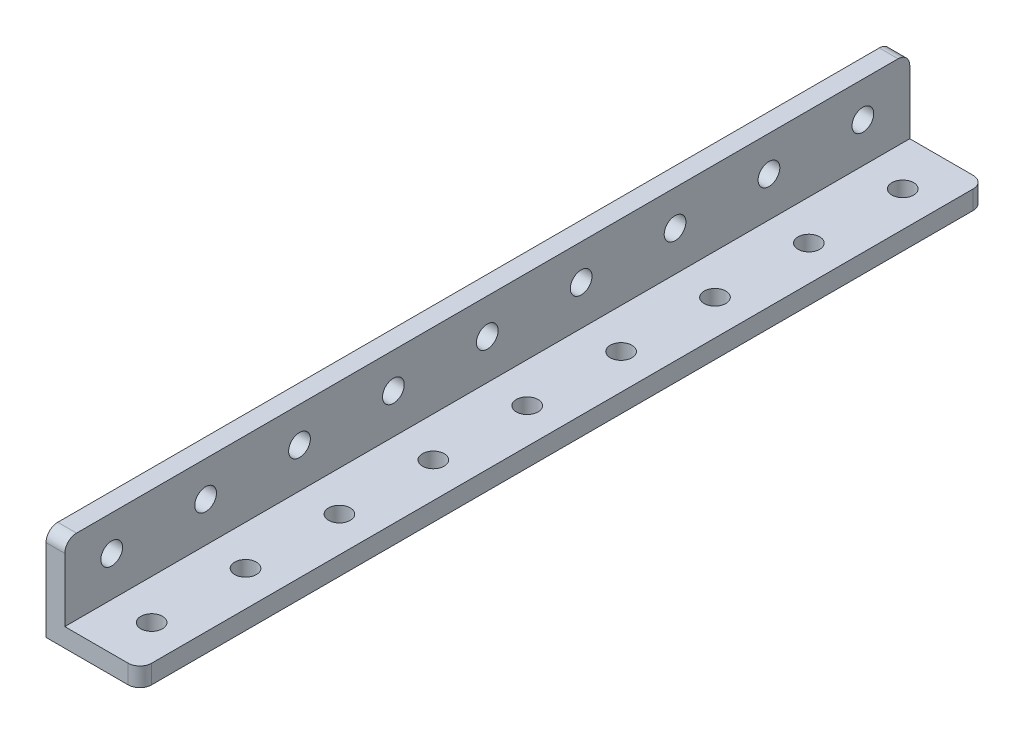
ISO-10303-21;
HEADER;
FILE_DESCRIPTION(('STEP AP214'),'2;1');
FILE_NAME('part.step','',(''),(''),'','','');
FILE_SCHEMA(('AUTOMOTIVE_DESIGN { 1 0 10303 214 1 1 1 1 }'));
ENDSEC;
DATA;
#1=APPLICATION_CONTEXT('core data for automotive mechanical design processes');
#2=APPLICATION_PROTOCOL_DEFINITION('international standard','automotive_design',2000,#1);
#3=PRODUCT_CONTEXT('',#1,'mechanical');
#4=PRODUCT('Part','Part','',(#3));
#5=PRODUCT_RELATED_PRODUCT_CATEGORY('part','',(#4));
#6=PRODUCT_DEFINITION_FORMATION('','',#4);
#7=PRODUCT_DEFINITION_CONTEXT('part definition',#1,'design');
#8=PRODUCT_DEFINITION('design','',#6,#7);
#9=PRODUCT_DEFINITION_SHAPE('','',#8);
#10=(LENGTH_UNIT() NAMED_UNIT(*) SI_UNIT(.MILLI.,.METRE.));
#11=(NAMED_UNIT(*) PLANE_ANGLE_UNIT() SI_UNIT($,.RADIAN.));
#12=(NAMED_UNIT(*) SI_UNIT($,.STERADIAN.) SOLID_ANGLE_UNIT());
#13=UNCERTAINTY_MEASURE_WITH_UNIT(LENGTH_MEASURE(1.E-05),#10,'distance_accuracy_value','');
#14=(GEOMETRIC_REPRESENTATION_CONTEXT(3) GLOBAL_UNCERTAINTY_ASSIGNED_CONTEXT((#13)) GLOBAL_UNIT_ASSIGNED_CONTEXT((#10,
#11,#12)) REPRESENTATION_CONTEXT('',''));
#15=CARTESIAN_POINT('',(0.,0.,0.));
#16=DIRECTION('',(0.,0.,1.));
#17=DIRECTION('',(1.,0.,0.));
#18=AXIS2_PLACEMENT_3D('',#15,#16,#17);
#19=CARTESIAN_POINT('',(0.,16.,-72.));
#20=DIRECTION('',(-1.,0.,0.));
#21=DIRECTION('',(0.,-1.,0.));
#22=AXIS2_PLACEMENT_3D('',#19,#20,#21);
#23=PLANE('',#22);
#24=CARTESIAN_POINT('',(0.,10.,-64.));
#25=DIRECTION('',(-1.,0.,0.));
#26=DIRECTION('',(0.,-1.,0.));
#27=AXIS2_PLACEMENT_3D('',#24,#25,#26);
#28=CIRCLE('',#27,1.85000000000003);
#29=CARTESIAN_POINT('',(0.,8.14999999999997,-64.));
#30=VERTEX_POINT('',#29);
#31=EDGE_CURVE('E691',#30,#30,#28,.T.);
#32=ORIENTED_EDGE('',*,*,#31,.F.);
#33=EDGE_LOOP('',(#32));
#34=FACE_BOUND('',#33,.T.);
#35=CARTESIAN_POINT('',(0.,10.,-48.));
#36=DIRECTION('',(-1.,0.,0.));
#37=DIRECTION('',(0.,-1.,0.));
#38=AXIS2_PLACEMENT_3D('',#35,#36,#37);
#39=CIRCLE('',#38,1.85000000000003);
#40=CARTESIAN_POINT('',(0.,8.14999999999997,-48.));
#41=VERTEX_POINT('',#40);
#42=EDGE_CURVE('E701',#41,#41,#39,.T.);
#43=ORIENTED_EDGE('',*,*,#42,.F.);
#44=EDGE_LOOP('',(#43));
#45=FACE_BOUND('',#44,.T.);
#46=CARTESIAN_POINT('',(0.,10.,-32.));
#47=DIRECTION('',(-1.,0.,0.));
#48=DIRECTION('',(0.,-1.,0.));
#49=AXIS2_PLACEMENT_3D('',#46,#47,#48);
#50=CIRCLE('',#49,1.85000000000003);
#51=CARTESIAN_POINT('',(0.,8.14999999999997,-32.));
#52=VERTEX_POINT('',#51);
#53=EDGE_CURVE('E711',#52,#52,#50,.T.);
#54=ORIENTED_EDGE('',*,*,#53,.F.);
#55=EDGE_LOOP('',(#54));
#56=FACE_BOUND('',#55,.T.);
#57=CARTESIAN_POINT('',(0.,10.,-16.));
#58=DIRECTION('',(-1.,0.,0.));
#59=DIRECTION('',(0.,-1.,0.));
#60=AXIS2_PLACEMENT_3D('',#57,#58,#59);
#61=CIRCLE('',#60,1.85000000000003);
#62=CARTESIAN_POINT('',(0.,8.14999999999997,-16.));
#63=VERTEX_POINT('',#62);
#64=EDGE_CURVE('E721',#63,#63,#61,.T.);
#65=ORIENTED_EDGE('',*,*,#64,.F.);
#66=EDGE_LOOP('',(#65));
#67=FACE_BOUND('',#66,.T.);
#68=CARTESIAN_POINT('',(0.,10.,0.));
#69=DIRECTION('',(-1.,0.,0.));
#70=DIRECTION('',(0.,-1.,0.));
#71=AXIS2_PLACEMENT_3D('',#68,#69,#70);
#72=CIRCLE('',#71,1.85000000000003);
#73=CARTESIAN_POINT('',(0.,8.14999999999997,0.));
#74=VERTEX_POINT('',#73);
#75=EDGE_CURVE('E731',#74,#74,#72,.T.);
#76=ORIENTED_EDGE('',*,*,#75,.F.);
#77=EDGE_LOOP('',(#76));
#78=FACE_BOUND('',#77,.T.);
#79=CARTESIAN_POINT('',(0.,10.,16.));
#80=DIRECTION('',(-1.,0.,0.));
#81=DIRECTION('',(0.,-1.,0.));
#82=AXIS2_PLACEMENT_3D('',#79,#80,#81);
#83=CIRCLE('',#82,1.85000000000003);
#84=CARTESIAN_POINT('',(0.,8.14999999999997,16.));
#85=VERTEX_POINT('',#84);
#86=EDGE_CURVE('E741',#85,#85,#83,.T.);
#87=ORIENTED_EDGE('',*,*,#86,.F.);
#88=EDGE_LOOP('',(#87));
#89=FACE_BOUND('',#88,.T.);
#90=CARTESIAN_POINT('',(0.,10.,32.));
#91=DIRECTION('',(-1.,0.,0.));
#92=DIRECTION('',(0.,-1.,0.));
#93=AXIS2_PLACEMENT_3D('',#90,#91,#92);
#94=CIRCLE('',#93,1.85000000000003);
#95=CARTESIAN_POINT('',(0.,8.14999999999997,32.));
#96=VERTEX_POINT('',#95);
#97=EDGE_CURVE('E751',#96,#96,#94,.T.);
#98=ORIENTED_EDGE('',*,*,#97,.F.);
#99=EDGE_LOOP('',(#98));
#100=FACE_BOUND('',#99,.T.);
#101=CARTESIAN_POINT('',(0.,10.,48.));
#102=DIRECTION('',(-1.,0.,0.));
#103=DIRECTION('',(0.,-1.,0.));
#104=AXIS2_PLACEMENT_3D('',#101,#102,#103);
#105=CIRCLE('',#104,1.85000000000003);
#106=CARTESIAN_POINT('',(0.,8.14999999999997,48.));
#107=VERTEX_POINT('',#106);
#108=EDGE_CURVE('E761',#107,#107,#105,.T.);
#109=ORIENTED_EDGE('',*,*,#108,.F.);
#110=EDGE_LOOP('',(#109));
#111=FACE_BOUND('',#110,.T.);
#112=CARTESIAN_POINT('',(0.,10.,64.));
#113=DIRECTION('',(-1.,0.,0.));
#114=DIRECTION('',(0.,-1.,0.));
#115=AXIS2_PLACEMENT_3D('',#112,#113,#114);
#116=CIRCLE('',#115,1.85000000000003);
#117=CARTESIAN_POINT('',(0.,8.14999999999997,64.));
#118=VERTEX_POINT('',#117);
#119=EDGE_CURVE('E158',#118,#118,#116,.T.);
#120=ORIENTED_EDGE('',*,*,#119,.F.);
#121=EDGE_LOOP('',(#120));
#122=FACE_BOUND('',#121,.T.);
#123=DIRECTION('',(0.,0.,1.));
#124=VECTOR('',#123,1.);
#125=CARTESIAN_POINT('',(0.,16.,-72.));
#126=LINE('',#125,#124);
#127=CARTESIAN_POINT('',(0.,16.,-70.));
#128=VERTEX_POINT('',#127);
#129=CARTESIAN_POINT('',(0.,16.,70.));
#130=VERTEX_POINT('',#129);
#131=EDGE_CURVE('E167',#128,#130,#126,.T.);
#132=ORIENTED_EDGE('',*,*,#131,.F.);
#133=CARTESIAN_POINT('',(0.,14.,-70.));
#134=DIRECTION('',(-1.,0.,0.));
#135=DIRECTION('',(0.,-1.,0.));
#136=AXIS2_PLACEMENT_3D('',#133,#134,#135);
#137=CIRCLE('',#136,2.);
#138=CARTESIAN_POINT('',(0.,14.,-72.));
#139=VERTEX_POINT('',#138);
#140=EDGE_CURVE('E46',#128,#139,#137,.T.);
#141=ORIENTED_EDGE('',*,*,#140,.T.);
#142=DIRECTION('',(0.,-1.,0.));
#143=VECTOR('',#142,1.);
#144=CARTESIAN_POINT('',(0.,16.,-72.));
#145=LINE('',#144,#143);
#146=CARTESIAN_POINT('',(0.,0.,-72.));
#147=VERTEX_POINT('',#146);
#148=EDGE_CURVE('E118',#139,#147,#145,.T.);
#149=ORIENTED_EDGE('',*,*,#148,.T.);
#150=DIRECTION('',(0.,0.,1.));
#151=VECTOR('',#150,1.);
#152=CARTESIAN_POINT('',(0.,0.,-72.));
#153=LINE('',#152,#151);
#154=CARTESIAN_POINT('',(0.,0.,72.));
#155=VERTEX_POINT('',#154);
#156=EDGE_CURVE('E120',#147,#155,#153,.T.);
#157=ORIENTED_EDGE('',*,*,#156,.T.);
#158=DIRECTION('',(0.,-1.,0.));
#159=VECTOR('',#158,1.);
#160=CARTESIAN_POINT('',(0.,16.,72.));
#161=LINE('',#160,#159);
#162=CARTESIAN_POINT('',(0.,14.,72.));
#163=VERTEX_POINT('',#162);
#164=EDGE_CURVE('E155',#163,#155,#161,.T.);
#165=ORIENTED_EDGE('',*,*,#164,.F.);
#166=CARTESIAN_POINT('',(0.,14.,70.));
#167=DIRECTION('',(-1.,0.,0.));
#168=DIRECTION('',(0.,-1.,0.));
#169=AXIS2_PLACEMENT_3D('',#166,#167,#168);
#170=CIRCLE('',#169,2.);
#171=EDGE_CURVE('E36',#163,#130,#170,.T.);
#172=ORIENTED_EDGE('',*,*,#171,.T.);
#173=EDGE_LOOP('',(#132,#141,#149,#157,#165,#172));
#174=FACE_BOUND('',#173,.T.);
#175=ADVANCED_FACE('F15',(#34,#45,#56,#67,#78,#89,#100,#111,#122,#174),#23,.T.);
#176=CARTESIAN_POINT('',(3.2,16.,-72.));
#177=DIRECTION('',(0.,1.,0.));
#178=DIRECTION('',(0.,0.,1.));
#179=AXIS2_PLACEMENT_3D('',#176,#177,#178);
#180=PLANE('',#179);
#181=DIRECTION('',(0.,0.,1.));
#182=VECTOR('',#181,1.);
#183=CARTESIAN_POINT('',(3.2,16.,-72.));
#184=LINE('',#183,#182);
#185=CARTESIAN_POINT('',(3.2,16.,-70.));
#186=VERTEX_POINT('',#185);
#187=CARTESIAN_POINT('',(3.2,16.,70.));
#188=VERTEX_POINT('',#187);
#189=EDGE_CURVE('E171',#186,#188,#184,.T.);
#190=ORIENTED_EDGE('',*,*,#189,.F.);
#191=DIRECTION('',(-1.,0.,0.));
#192=VECTOR('',#191,1.);
#193=CARTESIAN_POINT('',(3.2,16.,-70.));
#194=LINE('',#193,#192);
#195=EDGE_CURVE('E219',#186,#128,#194,.T.);
#196=ORIENTED_EDGE('',*,*,#195,.T.);
#197=ORIENTED_EDGE('',*,*,#131,.T.);
#198=DIRECTION('',(-1.,0.,0.));
#199=VECTOR('',#198,1.);
#200=CARTESIAN_POINT('',(3.2,16.,70.));
#201=LINE('',#200,#199);
#202=EDGE_CURVE('E216',#130,#188,#201,.F.);
#203=ORIENTED_EDGE('',*,*,#202,.T.);
#204=EDGE_LOOP('',(#190,#196,#197,#203));
#205=FACE_BOUND('',#204,.T.);
#206=ADVANCED_FACE('F240',(#205),#180,.T.);
#207=CARTESIAN_POINT('',(3.2,3.2,-72.));
#208=DIRECTION('',(1.,0.,0.));
#209=DIRECTION('',(0.,0.,-1.));
#210=AXIS2_PLACEMENT_3D('',#207,#208,#209);
#211=PLANE('',#210);
#212=CARTESIAN_POINT('',(3.2,10.,-64.));
#213=DIRECTION('',(1.,0.,0.));
#214=DIRECTION('',(0.,0.,-1.));
#215=AXIS2_PLACEMENT_3D('',#212,#213,#214);
#216=CIRCLE('',#215,1.85000000000003);
#217=CARTESIAN_POINT('',(3.2,10.,-65.85));
#218=VERTEX_POINT('',#217);
#219=EDGE_CURVE('E688',#218,#218,#216,.T.);
#220=ORIENTED_EDGE('',*,*,#219,.F.);
#221=EDGE_LOOP('',(#220));
#222=FACE_BOUND('',#221,.T.);
#223=CARTESIAN_POINT('',(3.2,10.,-48.));
#224=DIRECTION('',(1.,0.,0.));
#225=DIRECTION('',(0.,0.,-1.));
#226=AXIS2_PLACEMENT_3D('',#223,#224,#225);
#227=CIRCLE('',#226,1.85000000000003);
#228=CARTESIAN_POINT('',(3.2,10.,-49.85));
#229=VERTEX_POINT('',#228);
#230=EDGE_CURVE('E694',#229,#229,#227,.T.);
#231=ORIENTED_EDGE('',*,*,#230,.F.);
#232=EDGE_LOOP('',(#231));
#233=FACE_BOUND('',#232,.T.);
#234=CARTESIAN_POINT('',(3.2,10.,-32.));
#235=DIRECTION('',(1.,0.,0.));
#236=DIRECTION('',(0.,0.,-1.));
#237=AXIS2_PLACEMENT_3D('',#234,#235,#236);
#238=CIRCLE('',#237,1.85000000000003);
#239=CARTESIAN_POINT('',(3.2,10.,-33.85));
#240=VERTEX_POINT('',#239);
#241=EDGE_CURVE('E704',#240,#240,#238,.T.);
#242=ORIENTED_EDGE('',*,*,#241,.F.);
#243=EDGE_LOOP('',(#242));
#244=FACE_BOUND('',#243,.T.);
#245=CARTESIAN_POINT('',(3.2,10.,-16.));
#246=DIRECTION('',(1.,0.,0.));
#247=DIRECTION('',(0.,0.,-1.));
#248=AXIS2_PLACEMENT_3D('',#245,#246,#247);
#249=CIRCLE('',#248,1.85000000000003);
#250=CARTESIAN_POINT('',(3.2,10.,-17.85));
#251=VERTEX_POINT('',#250);
#252=EDGE_CURVE('E714',#251,#251,#249,.T.);
#253=ORIENTED_EDGE('',*,*,#252,.F.);
#254=EDGE_LOOP('',(#253));
#255=FACE_BOUND('',#254,.T.);
#256=CARTESIAN_POINT('',(3.2,10.,0.));
#257=DIRECTION('',(1.,0.,0.));
#258=DIRECTION('',(0.,0.,-1.));
#259=AXIS2_PLACEMENT_3D('',#256,#257,#258);
#260=CIRCLE('',#259,1.85000000000003);
#261=CARTESIAN_POINT('',(3.2,10.,-1.85000000000002));
#262=VERTEX_POINT('',#261);
#263=EDGE_CURVE('E724',#262,#262,#260,.T.);
#264=ORIENTED_EDGE('',*,*,#263,.F.);
#265=EDGE_LOOP('',(#264));
#266=FACE_BOUND('',#265,.T.);
#267=CARTESIAN_POINT('',(3.2,10.,16.));
#268=DIRECTION('',(1.,0.,0.));
#269=DIRECTION('',(0.,0.,-1.));
#270=AXIS2_PLACEMENT_3D('',#267,#268,#269);
#271=CIRCLE('',#270,1.85000000000003);
#272=CARTESIAN_POINT('',(3.2,10.,14.15));
#273=VERTEX_POINT('',#272);
#274=EDGE_CURVE('E734',#273,#273,#271,.T.);
#275=ORIENTED_EDGE('',*,*,#274,.F.);
#276=EDGE_LOOP('',(#275));
#277=FACE_BOUND('',#276,.T.);
#278=CARTESIAN_POINT('',(3.2,10.,32.));
#279=DIRECTION('',(1.,0.,0.));
#280=DIRECTION('',(0.,0.,-1.));
#281=AXIS2_PLACEMENT_3D('',#278,#279,#280);
#282=CIRCLE('',#281,1.85000000000003);
#283=CARTESIAN_POINT('',(3.2,10.,30.15));
#284=VERTEX_POINT('',#283);
#285=EDGE_CURVE('E744',#284,#284,#282,.T.);
#286=ORIENTED_EDGE('',*,*,#285,.F.);
#287=EDGE_LOOP('',(#286));
#288=FACE_BOUND('',#287,.T.);
#289=CARTESIAN_POINT('',(3.2,10.,48.));
#290=DIRECTION('',(1.,0.,0.));
#291=DIRECTION('',(0.,0.,-1.));
#292=AXIS2_PLACEMENT_3D('',#289,#290,#291);
#293=CIRCLE('',#292,1.85000000000003);
#294=CARTESIAN_POINT('',(3.2,10.,46.15));
#295=VERTEX_POINT('',#294);
#296=EDGE_CURVE('E754',#295,#295,#293,.T.);
#297=ORIENTED_EDGE('',*,*,#296,.F.);
#298=EDGE_LOOP('',(#297));
#299=FACE_BOUND('',#298,.T.);
#300=CARTESIAN_POINT('',(3.2,10.,64.));
#301=DIRECTION('',(1.,0.,0.));
#302=DIRECTION('',(0.,0.,-1.));
#303=AXIS2_PLACEMENT_3D('',#300,#301,#302);
#304=CIRCLE('',#303,1.85000000000003);
#305=CARTESIAN_POINT('',(3.2,10.,62.15));
#306=VERTEX_POINT('',#305);
#307=EDGE_CURVE('E778',#306,#306,#304,.T.);
#308=ORIENTED_EDGE('',*,*,#307,.F.);
#309=EDGE_LOOP('',(#308));
#310=FACE_BOUND('',#309,.T.);
#311=DIRECTION('',(0.,1.,0.));
#312=VECTOR('',#311,1.);
#313=CARTESIAN_POINT('',(3.2,3.2,-72.));
#314=LINE('',#313,#312);
#315=CARTESIAN_POINT('',(3.2,3.2,-72.));
#316=VERTEX_POINT('',#315);
#317=CARTESIAN_POINT('',(3.2,14.,-72.));
#318=VERTEX_POINT('',#317);
#319=EDGE_CURVE('E137',#316,#318,#314,.T.);
#320=ORIENTED_EDGE('',*,*,#319,.T.);
#321=CARTESIAN_POINT('',(3.2,14.,-70.));
#322=DIRECTION('',(1.,0.,0.));
#323=DIRECTION('',(0.,0.,-1.));
#324=AXIS2_PLACEMENT_3D('',#321,#322,#323);
#325=CIRCLE('',#324,2.);
#326=EDGE_CURVE('E10',#318,#186,#325,.T.);
#327=ORIENTED_EDGE('',*,*,#326,.T.);
#328=ORIENTED_EDGE('',*,*,#189,.T.);
#329=CARTESIAN_POINT('',(3.2,14.,70.));
#330=DIRECTION('',(1.,0.,0.));
#331=DIRECTION('',(0.,0.,-1.));
#332=AXIS2_PLACEMENT_3D('',#329,#330,#331);
#333=CIRCLE('',#332,2.);
#334=CARTESIAN_POINT('',(3.2,14.,72.));
#335=VERTEX_POINT('',#334);
#336=EDGE_CURVE('E24',#188,#335,#333,.T.);
#337=ORIENTED_EDGE('',*,*,#336,.T.);
#338=DIRECTION('',(0.,1.,0.));
#339=VECTOR('',#338,1.);
#340=CARTESIAN_POINT('',(3.2,3.2,72.));
#341=LINE('',#340,#339);
#342=CARTESIAN_POINT('',(3.2,3.2,72.));
#343=VERTEX_POINT('',#342);
#344=EDGE_CURVE('E126',#343,#335,#341,.T.);
#345=ORIENTED_EDGE('',*,*,#344,.F.);
#346=DIRECTION('',(0.,0.,1.));
#347=VECTOR('',#346,1.);
#348=CARTESIAN_POINT('',(3.2,3.2,-72.));
#349=LINE('',#348,#347);
#350=EDGE_CURVE('E175',#316,#343,#349,.T.);
#351=ORIENTED_EDGE('',*,*,#350,.F.);
#352=EDGE_LOOP('',(#320,#327,#328,#337,#345,#351));
#353=FACE_BOUND('',#352,.T.);
#354=ADVANCED_FACE('F230',(#222,#233,#244,#255,#266,#277,#288,#299,#310,#353),#211,.T.);
#355=CARTESIAN_POINT('',(16.,3.2,-72.));
#356=DIRECTION('',(0.,1.,0.));
#357=DIRECTION('',(-1.,0.,0.));
#358=AXIS2_PLACEMENT_3D('',#355,#356,#357);
#359=PLANE('',#358);
#360=CARTESIAN_POINT('',(10.,3.2,-64.));
#361=DIRECTION('',(0.,1.,0.));
#362=DIRECTION('',(-1.,0.,0.));
#363=AXIS2_PLACEMENT_3D('',#360,#361,#362);
#364=CIRCLE('',#363,1.85);
#365=CARTESIAN_POINT('',(8.15,3.2,-64.));
#366=VERTEX_POINT('',#365);
#367=EDGE_CURVE('E611',#366,#366,#364,.T.);
#368=ORIENTED_EDGE('',*,*,#367,.F.);
#369=EDGE_LOOP('',(#368));
#370=FACE_BOUND('',#369,.T.);
#371=CARTESIAN_POINT('',(10.,3.2,-48.));
#372=DIRECTION('',(0.,1.,0.));
#373=DIRECTION('',(-1.,0.,0.));
#374=AXIS2_PLACEMENT_3D('',#371,#372,#373);
#375=CIRCLE('',#374,1.85);
#376=CARTESIAN_POINT('',(8.15,3.2,-48.));
#377=VERTEX_POINT('',#376);
#378=EDGE_CURVE('E623',#377,#377,#375,.T.);
#379=ORIENTED_EDGE('',*,*,#378,.F.);
#380=EDGE_LOOP('',(#379));
#381=FACE_BOUND('',#380,.T.);
#382=CARTESIAN_POINT('',(10.,3.2,-32.));
#383=DIRECTION('',(0.,1.,0.));
#384=DIRECTION('',(-1.,0.,0.));
#385=AXIS2_PLACEMENT_3D('',#382,#383,#384);
#386=CIRCLE('',#385,1.85);
#387=CARTESIAN_POINT('',(8.15,3.2,-32.));
#388=VERTEX_POINT('',#387);
#389=EDGE_CURVE('E633',#388,#388,#386,.T.);
#390=ORIENTED_EDGE('',*,*,#389,.F.);
#391=EDGE_LOOP('',(#390));
#392=FACE_BOUND('',#391,.T.);
#393=CARTESIAN_POINT('',(10.,3.2,-16.));
#394=DIRECTION('',(0.,1.,0.));
#395=DIRECTION('',(-1.,0.,0.));
#396=AXIS2_PLACEMENT_3D('',#393,#394,#395);
#397=CIRCLE('',#396,1.85);
#398=CARTESIAN_POINT('',(8.15,3.2,-16.));
#399=VERTEX_POINT('',#398);
#400=EDGE_CURVE('E643',#399,#399,#397,.T.);
#401=ORIENTED_EDGE('',*,*,#400,.F.);
#402=EDGE_LOOP('',(#401));
#403=FACE_BOUND('',#402,.T.);
#404=CARTESIAN_POINT('',(10.,3.2,0.));
#405=DIRECTION('',(0.,1.,0.));
#406=DIRECTION('',(-1.,0.,0.));
#407=AXIS2_PLACEMENT_3D('',#404,#405,#406);
#408=CIRCLE('',#407,1.85);
#409=CARTESIAN_POINT('',(8.15,3.2,0.));
#410=VERTEX_POINT('',#409);
#411=EDGE_CURVE('E653',#410,#410,#408,.T.);
#412=ORIENTED_EDGE('',*,*,#411,.F.);
#413=EDGE_LOOP('',(#412));
#414=FACE_BOUND('',#413,.T.);
#415=CARTESIAN_POINT('',(10.,3.2,16.));
#416=DIRECTION('',(0.,1.,0.));
#417=DIRECTION('',(-1.,0.,0.));
#418=AXIS2_PLACEMENT_3D('',#415,#416,#417);
#419=CIRCLE('',#418,1.85);
#420=CARTESIAN_POINT('',(8.15,3.2,16.));
#421=VERTEX_POINT('',#420);
#422=EDGE_CURVE('E663',#421,#421,#419,.T.);
#423=ORIENTED_EDGE('',*,*,#422,.F.);
#424=EDGE_LOOP('',(#423));
#425=FACE_BOUND('',#424,.T.);
#426=CARTESIAN_POINT('',(10.,3.2,32.));
#427=DIRECTION('',(0.,1.,0.));
#428=DIRECTION('',(-1.,0.,0.));
#429=AXIS2_PLACEMENT_3D('',#426,#427,#428);
#430=CIRCLE('',#429,1.85);
#431=CARTESIAN_POINT('',(8.15,3.2,32.));
#432=VERTEX_POINT('',#431);
#433=EDGE_CURVE('E673',#432,#432,#430,.T.);
#434=ORIENTED_EDGE('',*,*,#433,.F.);
#435=EDGE_LOOP('',(#434));
#436=FACE_BOUND('',#435,.T.);
#437=CARTESIAN_POINT('',(10.,3.2,48.));
#438=DIRECTION('',(0.,1.,0.));
#439=DIRECTION('',(-1.,0.,0.));
#440=AXIS2_PLACEMENT_3D('',#437,#438,#439);
#441=CIRCLE('',#440,1.85);
#442=CARTESIAN_POINT('',(8.15,3.2,48.));
#443=VERTEX_POINT('',#442);
#444=EDGE_CURVE('E683',#443,#443,#441,.T.);
#445=ORIENTED_EDGE('',*,*,#444,.F.);
#446=EDGE_LOOP('',(#445));
#447=FACE_BOUND('',#446,.T.);
#448=CARTESIAN_POINT('',(10.,3.2,64.));
#449=DIRECTION('',(0.,1.,0.));
#450=DIRECTION('',(-1.,0.,0.));
#451=AXIS2_PLACEMENT_3D('',#448,#449,#450);
#452=CIRCLE('',#451,1.85);
#453=CARTESIAN_POINT('',(8.15,3.2,64.));
#454=VERTEX_POINT('',#453);
#455=EDGE_CURVE('E773',#454,#454,#452,.T.);
#456=ORIENTED_EDGE('',*,*,#455,.F.);
#457=EDGE_LOOP('',(#456));
#458=FACE_BOUND('',#457,.T.);
#459=DIRECTION('',(-1.,0.,0.));
#460=VECTOR('',#459,1.);
#461=CARTESIAN_POINT('',(16.,3.2,72.));
#462=LINE('',#461,#460);
#463=CARTESIAN_POINT('',(14.,3.2,72.));
#464=VERTEX_POINT('',#463);
#465=EDGE_CURVE('E161',#464,#343,#462,.T.);
#466=ORIENTED_EDGE('',*,*,#465,.F.);
#467=CARTESIAN_POINT('',(14.,3.2,70.));
#468=DIRECTION('',(0.,1.,0.));
#469=DIRECTION('',(-1.,0.,0.));
#470=AXIS2_PLACEMENT_3D('',#467,#468,#469);
#471=CIRCLE('',#470,2.);
#472=CARTESIAN_POINT('',(16.,3.2,70.));
#473=VERTEX_POINT('',#472);
#474=EDGE_CURVE('E195',#464,#473,#471,.T.);
#475=ORIENTED_EDGE('',*,*,#474,.T.);
#476=DIRECTION('',(0.,0.,1.));
#477=VECTOR('',#476,1.);
#478=CARTESIAN_POINT('',(16.,3.2,-72.));
#479=LINE('',#478,#477);
#480=CARTESIAN_POINT('',(16.,3.2,-70.));
#481=VERTEX_POINT('',#480);
#482=EDGE_CURVE('E179',#481,#473,#479,.T.);
#483=ORIENTED_EDGE('',*,*,#482,.F.);
#484=CARTESIAN_POINT('',(14.,3.2,-70.));
#485=DIRECTION('',(0.,1.,0.));
#486=DIRECTION('',(-1.,0.,0.));
#487=AXIS2_PLACEMENT_3D('',#484,#485,#486);
#488=CIRCLE('',#487,2.);
#489=CARTESIAN_POINT('',(14.,3.2,-72.));
#490=VERTEX_POINT('',#489);
#491=EDGE_CURVE('E192',#481,#490,#488,.T.);
#492=ORIENTED_EDGE('',*,*,#491,.T.);
#493=DIRECTION('',(-1.,0.,0.));
#494=VECTOR('',#493,1.);
#495=CARTESIAN_POINT('',(16.,3.2,-72.));
#496=LINE('',#495,#494);
#497=EDGE_CURVE('E144',#490,#316,#496,.T.);
#498=ORIENTED_EDGE('',*,*,#497,.T.);
#499=ORIENTED_EDGE('',*,*,#350,.T.);
#500=EDGE_LOOP('',(#466,#475,#483,#492,#498,#499));
#501=FACE_BOUND('',#500,.T.);
#502=ADVANCED_FACE('F257',(#370,#381,#392,#403,#414,#425,#436,#447,#458,#501),#359,.T.);
#503=CARTESIAN_POINT('',(16.,0.,-72.));
#504=DIRECTION('',(1.,0.,0.));
#505=DIRECTION('',(0.,0.,-1.));
#506=AXIS2_PLACEMENT_3D('',#503,#504,#505);
#507=PLANE('',#506);
#508=ORIENTED_EDGE('',*,*,#482,.T.);
#509=DIRECTION('',(0.,1.,0.));
#510=VECTOR('',#509,1.);
#511=CARTESIAN_POINT('',(16.,0.,70.));
#512=LINE('',#511,#510);
#513=CARTESIAN_POINT('',(16.,0.,70.));
#514=VERTEX_POINT('',#513);
#515=EDGE_CURVE('E202',#473,#514,#512,.F.);
#516=ORIENTED_EDGE('',*,*,#515,.T.);
#517=DIRECTION('',(0.,0.,1.));
#518=VECTOR('',#517,1.);
#519=CARTESIAN_POINT('',(16.,0.,-72.));
#520=LINE('',#519,#518);
#521=CARTESIAN_POINT('',(16.,0.,-70.));
#522=VERTEX_POINT('',#521);
#523=EDGE_CURVE('E136',#522,#514,#520,.T.);
#524=ORIENTED_EDGE('',*,*,#523,.F.);
#525=DIRECTION('',(0.,1.,0.));
#526=VECTOR('',#525,1.);
#527=CARTESIAN_POINT('',(16.,0.,-70.));
#528=LINE('',#527,#526);
#529=EDGE_CURVE('E198',#522,#481,#528,.T.);
#530=ORIENTED_EDGE('',*,*,#529,.T.);
#531=EDGE_LOOP('',(#508,#516,#524,#530));
#532=FACE_BOUND('',#531,.T.);
#533=ADVANCED_FACE('F251',(#532),#507,.T.);
#534=CARTESIAN_POINT('',(0.,0.,-72.));
#535=DIRECTION('',(0.,-1.,0.));
#536=DIRECTION('',(0.,0.,-1.));
#537=AXIS2_PLACEMENT_3D('',#534,#535,#536);
#538=PLANE('',#537);
#539=CARTESIAN_POINT('',(10.,0.,-64.));
#540=DIRECTION('',(0.,-1.,0.));
#541=DIRECTION('',(0.,0.,-1.));
#542=AXIS2_PLACEMENT_3D('',#539,#540,#541);
#543=CIRCLE('',#542,1.85);
#544=CARTESIAN_POINT('',(10.,0.,-65.85));
#545=VERTEX_POINT('',#544);
#546=EDGE_CURVE('E607',#545,#545,#543,.F.);
#547=ORIENTED_EDGE('',*,*,#546,.T.);
#548=EDGE_LOOP('',(#547));
#549=FACE_BOUND('',#548,.T.);
#550=CARTESIAN_POINT('',(10.,0.,-48.));
#551=DIRECTION('',(0.,-1.,0.));
#552=DIRECTION('',(0.,0.,-1.));
#553=AXIS2_PLACEMENT_3D('',#550,#551,#552);
#554=CIRCLE('',#553,1.85);
#555=CARTESIAN_POINT('',(10.,0.,-49.85));
#556=VERTEX_POINT('',#555);
#557=EDGE_CURVE('E616',#556,#556,#554,.F.);
#558=ORIENTED_EDGE('',*,*,#557,.T.);
#559=EDGE_LOOP('',(#558));
#560=FACE_BOUND('',#559,.T.);
#561=CARTESIAN_POINT('',(10.,0.,-32.));
#562=DIRECTION('',(0.,-1.,0.));
#563=DIRECTION('',(0.,0.,-1.));
#564=AXIS2_PLACEMENT_3D('',#561,#562,#563);
#565=CIRCLE('',#564,1.85);
#566=CARTESIAN_POINT('',(10.,0.,-33.85));
#567=VERTEX_POINT('',#566);
#568=EDGE_CURVE('E628',#567,#567,#565,.F.);
#569=ORIENTED_EDGE('',*,*,#568,.T.);
#570=EDGE_LOOP('',(#569));
#571=FACE_BOUND('',#570,.T.);
#572=CARTESIAN_POINT('',(10.,0.,-16.));
#573=DIRECTION('',(0.,-1.,0.));
#574=DIRECTION('',(0.,0.,-1.));
#575=AXIS2_PLACEMENT_3D('',#572,#573,#574);
#576=CIRCLE('',#575,1.85);
#577=CARTESIAN_POINT('',(10.,0.,-17.85));
#578=VERTEX_POINT('',#577);
#579=EDGE_CURVE('E638',#578,#578,#576,.F.);
#580=ORIENTED_EDGE('',*,*,#579,.T.);
#581=EDGE_LOOP('',(#580));
#582=FACE_BOUND('',#581,.T.);
#583=CARTESIAN_POINT('',(10.,0.,0.));
#584=DIRECTION('',(0.,-1.,0.));
#585=DIRECTION('',(0.,0.,-1.));
#586=AXIS2_PLACEMENT_3D('',#583,#584,#585);
#587=CIRCLE('',#586,1.85);
#588=CARTESIAN_POINT('',(10.,0.,-1.84999999999999));
#589=VERTEX_POINT('',#588);
#590=EDGE_CURVE('E648',#589,#589,#587,.F.);
#591=ORIENTED_EDGE('',*,*,#590,.T.);
#592=EDGE_LOOP('',(#591));
#593=FACE_BOUND('',#592,.T.);
#594=CARTESIAN_POINT('',(10.,0.,16.));
#595=DIRECTION('',(0.,-1.,0.));
#596=DIRECTION('',(0.,0.,-1.));
#597=AXIS2_PLACEMENT_3D('',#594,#595,#596);
#598=CIRCLE('',#597,1.85);
#599=CARTESIAN_POINT('',(10.,0.,14.15));
#600=VERTEX_POINT('',#599);
#601=EDGE_CURVE('E658',#600,#600,#598,.F.);
#602=ORIENTED_EDGE('',*,*,#601,.T.);
#603=EDGE_LOOP('',(#602));
#604=FACE_BOUND('',#603,.T.);
#605=CARTESIAN_POINT('',(10.,0.,32.));
#606=DIRECTION('',(0.,-1.,0.));
#607=DIRECTION('',(0.,0.,-1.));
#608=AXIS2_PLACEMENT_3D('',#605,#606,#607);
#609=CIRCLE('',#608,1.85);
#610=CARTESIAN_POINT('',(10.,0.,30.15));
#611=VERTEX_POINT('',#610);
#612=EDGE_CURVE('E668',#611,#611,#609,.F.);
#613=ORIENTED_EDGE('',*,*,#612,.T.);
#614=EDGE_LOOP('',(#613));
#615=FACE_BOUND('',#614,.T.);
#616=CARTESIAN_POINT('',(10.,0.,48.));
#617=DIRECTION('',(0.,-1.,0.));
#618=DIRECTION('',(0.,0.,-1.));
#619=AXIS2_PLACEMENT_3D('',#616,#617,#618);
#620=CIRCLE('',#619,1.85);
#621=CARTESIAN_POINT('',(10.,0.,46.15));
#622=VERTEX_POINT('',#621);
#623=EDGE_CURVE('E678',#622,#622,#620,.F.);
#624=ORIENTED_EDGE('',*,*,#623,.T.);
#625=EDGE_LOOP('',(#624));
#626=FACE_BOUND('',#625,.T.);
#627=CARTESIAN_POINT('',(10.,0.,64.));
#628=DIRECTION('',(0.,-1.,0.));
#629=DIRECTION('',(0.,0.,-1.));
#630=AXIS2_PLACEMENT_3D('',#627,#628,#629);
#631=CIRCLE('',#630,1.85);
#632=CARTESIAN_POINT('',(10.,0.,62.15));
#633=VERTEX_POINT('',#632);
#634=EDGE_CURVE('E764',#633,#633,#631,.F.);
#635=ORIENTED_EDGE('',*,*,#634,.T.);
#636=EDGE_LOOP('',(#635));
#637=FACE_BOUND('',#636,.T.);
#638=ORIENTED_EDGE('',*,*,#523,.T.);
#639=CARTESIAN_POINT('',(14.,0.,70.));
#640=DIRECTION('',(0.,-1.,0.));
#641=DIRECTION('',(0.,0.,-1.));
#642=AXIS2_PLACEMENT_3D('',#639,#640,#641);
#643=CIRCLE('',#642,2.);
#644=CARTESIAN_POINT('',(14.,0.,72.));
#645=VERTEX_POINT('',#644);
#646=EDGE_CURVE('E208',#514,#645,#643,.T.);
#647=ORIENTED_EDGE('',*,*,#646,.T.);
#648=DIRECTION('',(1.,0.,0.));
#649=VECTOR('',#648,1.);
#650=CARTESIAN_POINT('',(0.,0.,72.));
#651=LINE('',#650,#649);
#652=EDGE_CURVE('E134',#155,#645,#651,.T.);
#653=ORIENTED_EDGE('',*,*,#652,.F.);
#654=ORIENTED_EDGE('',*,*,#156,.F.);
#655=DIRECTION('',(1.,0.,0.));
#656=VECTOR('',#655,1.);
#657=CARTESIAN_POINT('',(0.,0.,-72.));
#658=LINE('',#657,#656);
#659=CARTESIAN_POINT('',(14.,0.,-72.));
#660=VERTEX_POINT('',#659);
#661=EDGE_CURVE('E125',#147,#660,#658,.T.);
#662=ORIENTED_EDGE('',*,*,#661,.T.);
#663=CARTESIAN_POINT('',(14.,0.,-70.));
#664=DIRECTION('',(0.,-1.,0.));
#665=DIRECTION('',(0.,0.,-1.));
#666=AXIS2_PLACEMENT_3D('',#663,#664,#665);
#667=CIRCLE('',#666,2.);
#668=EDGE_CURVE('E205',#660,#522,#667,.T.);
#669=ORIENTED_EDGE('',*,*,#668,.T.);
#670=EDGE_LOOP('',(#638,#647,#653,#654,#662,#669));
#671=FACE_BOUND('',#670,.T.);
#672=ADVANCED_FACE('F131',(#549,#560,#571,#582,#593,#604,#615,#626,#637,#671),#538,.T.);
#673=CARTESIAN_POINT('',(0.,16.,-72.));
#674=DIRECTION('',(0.,0.,-1.));
#675=DIRECTION('',(-1.,0.,0.));
#676=AXIS2_PLACEMENT_3D('',#673,#674,#675);
#677=PLANE('',#676);
#678=ORIENTED_EDGE('',*,*,#497,.F.);
#679=DIRECTION('',(0.,1.,0.));
#680=VECTOR('',#679,1.);
#681=CARTESIAN_POINT('',(14.,16.,-72.));
#682=LINE('',#681,#680);
#683=EDGE_CURVE('E142',#490,#660,#682,.F.);
#684=ORIENTED_EDGE('',*,*,#683,.T.);
#685=ORIENTED_EDGE('',*,*,#661,.F.);
#686=ORIENTED_EDGE('',*,*,#148,.F.);
#687=DIRECTION('',(-1.,0.,0.));
#688=VECTOR('',#687,1.);
#689=CARTESIAN_POINT('',(0.,14.,-72.));
#690=LINE('',#689,#688);
#691=EDGE_CURVE('E211',#139,#318,#690,.F.);
#692=ORIENTED_EDGE('',*,*,#691,.T.);
#693=ORIENTED_EDGE('',*,*,#319,.F.);
#694=EDGE_LOOP('',(#678,#684,#685,#686,#692,#693));
#695=FACE_BOUND('',#694,.T.);
#696=ADVANCED_FACE('F140',(#695),#677,.T.);
#697=CARTESIAN_POINT('',(0.,16.,72.));
#698=DIRECTION('',(0.,0.,-1.));
#699=DIRECTION('',(-1.,0.,0.));
#700=AXIS2_PLACEMENT_3D('',#697,#698,#699);
#701=PLANE('',#700);
#702=ORIENTED_EDGE('',*,*,#652,.T.);
#703=DIRECTION('',(0.,1.,0.));
#704=VECTOR('',#703,1.);
#705=CARTESIAN_POINT('',(14.,3.2,72.));
#706=LINE('',#705,#704);
#707=EDGE_CURVE('E188',#645,#464,#706,.T.);
#708=ORIENTED_EDGE('',*,*,#707,.T.);
#709=ORIENTED_EDGE('',*,*,#465,.T.);
#710=ORIENTED_EDGE('',*,*,#344,.T.);
#711=DIRECTION('',(-1.,0.,0.));
#712=VECTOR('',#711,1.);
#713=CARTESIAN_POINT('',(0.,14.,72.));
#714=LINE('',#713,#712);
#715=EDGE_CURVE('E170',#335,#163,#714,.T.);
#716=ORIENTED_EDGE('',*,*,#715,.T.);
#717=ORIENTED_EDGE('',*,*,#164,.T.);
#718=EDGE_LOOP('',(#702,#708,#709,#710,#716,#717));
#719=FACE_BOUND('',#718,.T.);
#720=ADVANCED_FACE('F237',(#719),#701,.F.);
#721=CARTESIAN_POINT('',(14.,16.,70.));
#722=DIRECTION('',(0.,-1.,0.));
#723=DIRECTION('',(0.,0.,-1.));
#724=AXIS2_PLACEMENT_3D('',#721,#722,#723);
#725=CYLINDRICAL_SURFACE('',#724,2.);
#726=ORIENTED_EDGE('',*,*,#646,.F.);
#727=ORIENTED_EDGE('',*,*,#515,.F.);
#728=ORIENTED_EDGE('',*,*,#474,.F.);
#729=ORIENTED_EDGE('',*,*,#707,.F.);
#730=EDGE_LOOP('',(#726,#727,#728,#729));
#731=FACE_BOUND('',#730,.T.);
#732=ADVANCED_FACE('F255',(#731),#725,.T.);
#733=CARTESIAN_POINT('',(14.,0.,-70.));
#734=DIRECTION('',(0.,1.,0.));
#735=DIRECTION('',(0.,0.,1.));
#736=AXIS2_PLACEMENT_3D('',#733,#734,#735);
#737=CYLINDRICAL_SURFACE('',#736,2.);
#738=ORIENTED_EDGE('',*,*,#668,.F.);
#739=ORIENTED_EDGE('',*,*,#683,.F.);
#740=ORIENTED_EDGE('',*,*,#491,.F.);
#741=ORIENTED_EDGE('',*,*,#529,.F.);
#742=EDGE_LOOP('',(#738,#739,#740,#741));
#743=FACE_BOUND('',#742,.T.);
#744=ADVANCED_FACE('F246',(#743),#737,.T.);
#745=CARTESIAN_POINT('',(3.2,14.,-70.));
#746=DIRECTION('',(-1.,0.,0.));
#747=DIRECTION('',(0.,0.,1.));
#748=AXIS2_PLACEMENT_3D('',#745,#746,#747);
#749=CYLINDRICAL_SURFACE('',#748,2.);
#750=ORIENTED_EDGE('',*,*,#326,.F.);
#751=ORIENTED_EDGE('',*,*,#691,.F.);
#752=ORIENTED_EDGE('',*,*,#140,.F.);
#753=ORIENTED_EDGE('',*,*,#195,.F.);
#754=EDGE_LOOP('',(#750,#751,#752,#753));
#755=FACE_BOUND('',#754,.T.);
#756=ADVANCED_FACE('F242',(#755),#749,.T.);
#757=CARTESIAN_POINT('',(0.,14.,70.));
#758=DIRECTION('',(1.,0.,0.));
#759=DIRECTION('',(0.,0.,-1.));
#760=AXIS2_PLACEMENT_3D('',#757,#758,#759);
#761=CYLINDRICAL_SURFACE('',#760,2.);
#762=ORIENTED_EDGE('',*,*,#336,.F.);
#763=ORIENTED_EDGE('',*,*,#202,.F.);
#764=ORIENTED_EDGE('',*,*,#171,.F.);
#765=ORIENTED_EDGE('',*,*,#715,.F.);
#766=EDGE_LOOP('',(#762,#763,#764,#765));
#767=FACE_BOUND('',#766,.T.);
#768=ADVANCED_FACE('F17',(#767),#761,.T.);
#769=CARTESIAN_POINT('',(16.,10.,64.));
#770=DIRECTION('',(-1.,0.,0.));
#771=DIRECTION('',(0.,-1.,0.));
#772=AXIS2_PLACEMENT_3D('',#769,#770,#771);
#773=CYLINDRICAL_SURFACE('',#772,1.85000000000003);
#774=ORIENTED_EDGE('',*,*,#307,.T.);
#775=EDGE_LOOP('',(#774));
#776=FACE_BOUND('',#775,.T.);
#777=ORIENTED_EDGE('',*,*,#119,.T.);
#778=EDGE_LOOP('',(#777));
#779=FACE_BOUND('',#778,.T.);
#780=ADVANCED_FACE('F289',(#776,#779),#773,.F.);
#781=CARTESIAN_POINT('',(10.,-0.00100000000000057,64.));
#782=DIRECTION('',(0.,1.,0.));
#783=DIRECTION('',(-1.,0.,0.));
#784=AXIS2_PLACEMENT_3D('',#781,#782,#783);
#785=CYLINDRICAL_SURFACE('',#784,1.85);
#786=ORIENTED_EDGE('',*,*,#634,.F.);
#787=EDGE_LOOP('',(#786));
#788=FACE_BOUND('',#787,.T.);
#789=ORIENTED_EDGE('',*,*,#455,.T.);
#790=EDGE_LOOP('',(#789));
#791=FACE_BOUND('',#790,.T.);
#792=ADVANCED_FACE('F293',(#788,#791),#785,.F.);
#793=CARTESIAN_POINT('',(16.,10.,48.));
#794=DIRECTION('',(-1.,0.,0.));
#795=DIRECTION('',(0.,-1.,0.));
#796=AXIS2_PLACEMENT_3D('',#793,#794,#795);
#797=CYLINDRICAL_SURFACE('',#796,1.85000000000003);
#798=ORIENTED_EDGE('',*,*,#296,.T.);
#799=EDGE_LOOP('',(#798));
#800=FACE_BOUND('',#799,.T.);
#801=ORIENTED_EDGE('',*,*,#108,.T.);
#802=EDGE_LOOP('',(#801));
#803=FACE_BOUND('',#802,.T.);
#804=ADVANCED_FACE('F299',(#800,#803),#797,.F.);
#805=CARTESIAN_POINT('',(16.,10.,32.));
#806=DIRECTION('',(-1.,0.,0.));
#807=DIRECTION('',(0.,-1.,0.));
#808=AXIS2_PLACEMENT_3D('',#805,#806,#807);
#809=CYLINDRICAL_SURFACE('',#808,1.85000000000003);
#810=ORIENTED_EDGE('',*,*,#285,.T.);
#811=EDGE_LOOP('',(#810));
#812=FACE_BOUND('',#811,.T.);
#813=ORIENTED_EDGE('',*,*,#97,.T.);
#814=EDGE_LOOP('',(#813));
#815=FACE_BOUND('',#814,.T.);
#816=ADVANCED_FACE('F371',(#812,#815),#809,.F.);
#817=CARTESIAN_POINT('',(16.,10.,16.));
#818=DIRECTION('',(-1.,0.,0.));
#819=DIRECTION('',(0.,-1.,0.));
#820=AXIS2_PLACEMENT_3D('',#817,#818,#819);
#821=CYLINDRICAL_SURFACE('',#820,1.85000000000003);
#822=ORIENTED_EDGE('',*,*,#274,.T.);
#823=EDGE_LOOP('',(#822));
#824=FACE_BOUND('',#823,.T.);
#825=ORIENTED_EDGE('',*,*,#86,.T.);
#826=EDGE_LOOP('',(#825));
#827=FACE_BOUND('',#826,.T.);
#828=ADVANCED_FACE('F384',(#824,#827),#821,.F.);
#829=CARTESIAN_POINT('',(16.,10.,0.));
#830=DIRECTION('',(-1.,0.,0.));
#831=DIRECTION('',(0.,-1.,0.));
#832=AXIS2_PLACEMENT_3D('',#829,#830,#831);
#833=CYLINDRICAL_SURFACE('',#832,1.85000000000003);
#834=ORIENTED_EDGE('',*,*,#263,.T.);
#835=EDGE_LOOP('',(#834));
#836=FACE_BOUND('',#835,.T.);
#837=ORIENTED_EDGE('',*,*,#75,.T.);
#838=EDGE_LOOP('',(#837));
#839=FACE_BOUND('',#838,.T.);
#840=ADVANCED_FACE('F398',(#836,#839),#833,.F.);
#841=CARTESIAN_POINT('',(16.,10.,-16.));
#842=DIRECTION('',(-1.,0.,0.));
#843=DIRECTION('',(0.,-1.,0.));
#844=AXIS2_PLACEMENT_3D('',#841,#842,#843);
#845=CYLINDRICAL_SURFACE('',#844,1.85000000000003);
#846=ORIENTED_EDGE('',*,*,#252,.T.);
#847=EDGE_LOOP('',(#846));
#848=FACE_BOUND('',#847,.T.);
#849=ORIENTED_EDGE('',*,*,#64,.T.);
#850=EDGE_LOOP('',(#849));
#851=FACE_BOUND('',#850,.T.);
#852=ADVANCED_FACE('F412',(#848,#851),#845,.F.);
#853=CARTESIAN_POINT('',(16.,10.,-32.));
#854=DIRECTION('',(-1.,0.,0.));
#855=DIRECTION('',(0.,-1.,0.));
#856=AXIS2_PLACEMENT_3D('',#853,#854,#855);
#857=CYLINDRICAL_SURFACE('',#856,1.85000000000003);
#858=ORIENTED_EDGE('',*,*,#241,.T.);
#859=EDGE_LOOP('',(#858));
#860=FACE_BOUND('',#859,.T.);
#861=ORIENTED_EDGE('',*,*,#53,.T.);
#862=EDGE_LOOP('',(#861));
#863=FACE_BOUND('',#862,.T.);
#864=ADVANCED_FACE('F426',(#860,#863),#857,.F.);
#865=CARTESIAN_POINT('',(16.,10.,-48.));
#866=DIRECTION('',(-1.,0.,0.));
#867=DIRECTION('',(0.,-1.,0.));
#868=AXIS2_PLACEMENT_3D('',#865,#866,#867);
#869=CYLINDRICAL_SURFACE('',#868,1.85000000000003);
#870=ORIENTED_EDGE('',*,*,#230,.T.);
#871=EDGE_LOOP('',(#870));
#872=FACE_BOUND('',#871,.T.);
#873=ORIENTED_EDGE('',*,*,#42,.T.);
#874=EDGE_LOOP('',(#873));
#875=FACE_BOUND('',#874,.T.);
#876=ADVANCED_FACE('F440',(#872,#875),#869,.F.);
#877=CARTESIAN_POINT('',(16.,10.,-64.));
#878=DIRECTION('',(-1.,0.,0.));
#879=DIRECTION('',(0.,-1.,0.));
#880=AXIS2_PLACEMENT_3D('',#877,#878,#879);
#881=CYLINDRICAL_SURFACE('',#880,1.85000000000003);
#882=ORIENTED_EDGE('',*,*,#219,.T.);
#883=EDGE_LOOP('',(#882));
#884=FACE_BOUND('',#883,.T.);
#885=ORIENTED_EDGE('',*,*,#31,.T.);
#886=EDGE_LOOP('',(#885));
#887=FACE_BOUND('',#886,.T.);
#888=ADVANCED_FACE('F454',(#884,#887),#881,.F.);
#889=CARTESIAN_POINT('',(10.,-0.00100000000000057,48.));
#890=DIRECTION('',(0.,1.,0.));
#891=DIRECTION('',(-1.,0.,0.));
#892=AXIS2_PLACEMENT_3D('',#889,#890,#891);
#893=CYLINDRICAL_SURFACE('',#892,1.85);
#894=ORIENTED_EDGE('',*,*,#623,.F.);
#895=EDGE_LOOP('',(#894));
#896=FACE_BOUND('',#895,.T.);
#897=ORIENTED_EDGE('',*,*,#444,.T.);
#898=EDGE_LOOP('',(#897));
#899=FACE_BOUND('',#898,.T.);
#900=ADVANCED_FACE('F468',(#896,#899),#893,.F.);
#901=CARTESIAN_POINT('',(10.,-0.00100000000000057,32.));
#902=DIRECTION('',(0.,1.,0.));
#903=DIRECTION('',(-1.,0.,0.));
#904=AXIS2_PLACEMENT_3D('',#901,#902,#903);
#905=CYLINDRICAL_SURFACE('',#904,1.85);
#906=ORIENTED_EDGE('',*,*,#612,.F.);
#907=EDGE_LOOP('',(#906));
#908=FACE_BOUND('',#907,.T.);
#909=ORIENTED_EDGE('',*,*,#433,.T.);
#910=EDGE_LOOP('',(#909));
#911=FACE_BOUND('',#910,.T.);
#912=ADVANCED_FACE('F482',(#908,#911),#905,.F.);
#913=CARTESIAN_POINT('',(10.,-0.00100000000000057,16.));
#914=DIRECTION('',(0.,1.,0.));
#915=DIRECTION('',(-1.,0.,0.));
#916=AXIS2_PLACEMENT_3D('',#913,#914,#915);
#917=CYLINDRICAL_SURFACE('',#916,1.85);
#918=ORIENTED_EDGE('',*,*,#601,.F.);
#919=EDGE_LOOP('',(#918));
#920=FACE_BOUND('',#919,.T.);
#921=ORIENTED_EDGE('',*,*,#422,.T.);
#922=EDGE_LOOP('',(#921));
#923=FACE_BOUND('',#922,.T.);
#924=ADVANCED_FACE('F496',(#920,#923),#917,.F.);
#925=CARTESIAN_POINT('',(10.,-0.00100000000000057,0.));
#926=DIRECTION('',(0.,1.,0.));
#927=DIRECTION('',(-1.,0.,0.));
#928=AXIS2_PLACEMENT_3D('',#925,#926,#927);
#929=CYLINDRICAL_SURFACE('',#928,1.85);
#930=ORIENTED_EDGE('',*,*,#590,.F.);
#931=EDGE_LOOP('',(#930));
#932=FACE_BOUND('',#931,.T.);
#933=ORIENTED_EDGE('',*,*,#411,.T.);
#934=EDGE_LOOP('',(#933));
#935=FACE_BOUND('',#934,.T.);
#936=ADVANCED_FACE('F510',(#932,#935),#929,.F.);
#937=CARTESIAN_POINT('',(10.,-0.00100000000000057,-16.));
#938=DIRECTION('',(0.,1.,0.));
#939=DIRECTION('',(-1.,0.,0.));
#940=AXIS2_PLACEMENT_3D('',#937,#938,#939);
#941=CYLINDRICAL_SURFACE('',#940,1.85);
#942=ORIENTED_EDGE('',*,*,#579,.F.);
#943=EDGE_LOOP('',(#942));
#944=FACE_BOUND('',#943,.T.);
#945=ORIENTED_EDGE('',*,*,#400,.T.);
#946=EDGE_LOOP('',(#945));
#947=FACE_BOUND('',#946,.T.);
#948=ADVANCED_FACE('F524',(#944,#947),#941,.F.);
#949=CARTESIAN_POINT('',(10.,-0.00100000000000057,-32.));
#950=DIRECTION('',(0.,1.,0.));
#951=DIRECTION('',(-1.,0.,0.));
#952=AXIS2_PLACEMENT_3D('',#949,#950,#951);
#953=CYLINDRICAL_SURFACE('',#952,1.85);
#954=ORIENTED_EDGE('',*,*,#568,.F.);
#955=EDGE_LOOP('',(#954));
#956=FACE_BOUND('',#955,.T.);
#957=ORIENTED_EDGE('',*,*,#389,.T.);
#958=EDGE_LOOP('',(#957));
#959=FACE_BOUND('',#958,.T.);
#960=ADVANCED_FACE('F538',(#956,#959),#953,.F.);
#961=CARTESIAN_POINT('',(10.,-0.00100000000000057,-48.));
#962=DIRECTION('',(0.,1.,0.));
#963=DIRECTION('',(-1.,0.,0.));
#964=AXIS2_PLACEMENT_3D('',#961,#962,#963);
#965=CYLINDRICAL_SURFACE('',#964,1.85);
#966=ORIENTED_EDGE('',*,*,#557,.F.);
#967=EDGE_LOOP('',(#966));
#968=FACE_BOUND('',#967,.T.);
#969=ORIENTED_EDGE('',*,*,#378,.T.);
#970=EDGE_LOOP('',(#969));
#971=FACE_BOUND('',#970,.T.);
#972=ADVANCED_FACE('F552',(#968,#971),#965,.F.);
#973=CARTESIAN_POINT('',(10.,-0.00100000000000057,-64.));
#974=DIRECTION('',(0.,1.,0.));
#975=DIRECTION('',(-1.,0.,0.));
#976=AXIS2_PLACEMENT_3D('',#973,#974,#975);
#977=CYLINDRICAL_SURFACE('',#976,1.85);
#978=ORIENTED_EDGE('',*,*,#546,.F.);
#979=EDGE_LOOP('',(#978));
#980=FACE_BOUND('',#979,.T.);
#981=ORIENTED_EDGE('',*,*,#367,.T.);
#982=EDGE_LOOP('',(#981));
#983=FACE_BOUND('',#982,.T.);
#984=ADVANCED_FACE('F566',(#980,#983),#977,.F.);
#985=CLOSED_SHELL('',(#175,#206,#354,#502,#533,#672,#696,#720,#732,#744,#756,#768,#780,#792,
#804,#816,#828,#840,#852,#864,#876,#888,#900,#912,#924,#936,#948,#960,#972,#984));
#986=MANIFOLD_SOLID_BREP('B1',#985);
#987=ADVANCED_BREP_SHAPE_REPRESENTATION('',(#18,#986),#14);
#988=SHAPE_DEFINITION_REPRESENTATION(#9,#987);
ENDSEC;
END-ISO-10303-21;
